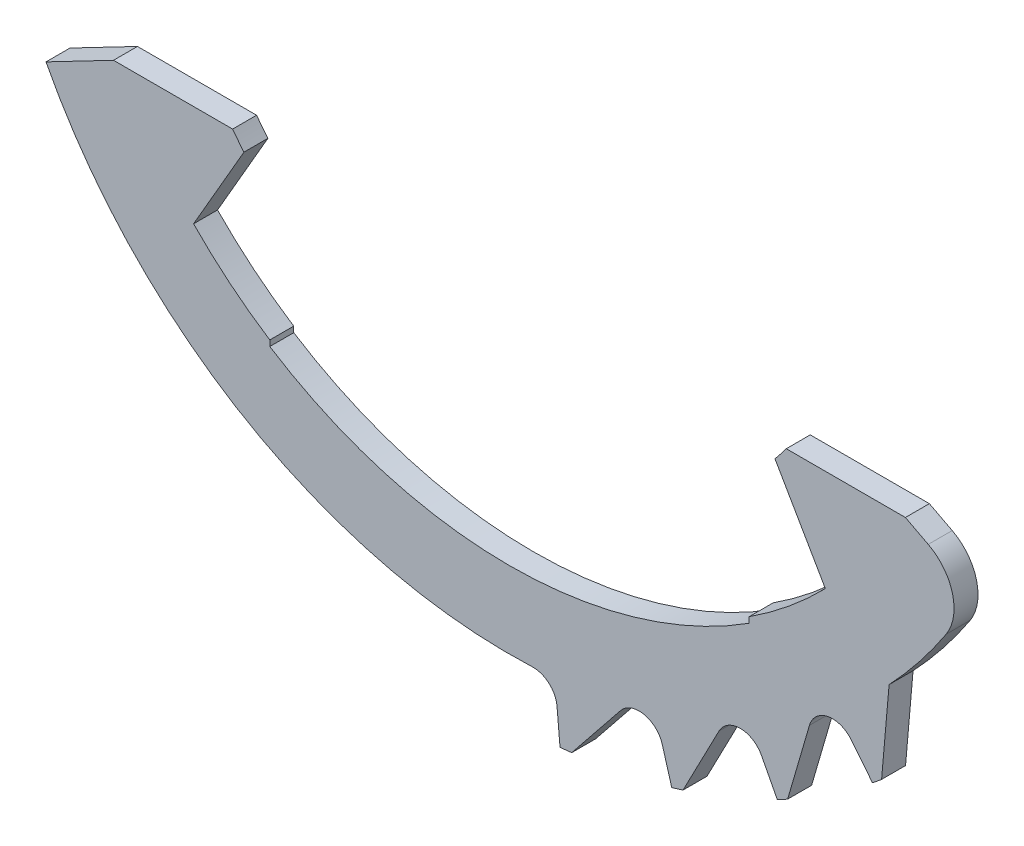
ISO-10303-21;
HEADER;
FILE_DESCRIPTION(('STEP AP214'),'2;1');
FILE_NAME('part.step','',(''),(''),'','','');
FILE_SCHEMA(('AUTOMOTIVE_DESIGN { 1 0 10303 214 1 1 1 1 }'));
ENDSEC;
DATA;
#1=APPLICATION_CONTEXT('core data for automotive mechanical design processes');
#2=APPLICATION_PROTOCOL_DEFINITION('international standard','automotive_design',2000,#1);
#3=PRODUCT_CONTEXT('',#1,'mechanical');
#4=PRODUCT('Part','Part','',(#3));
#5=PRODUCT_RELATED_PRODUCT_CATEGORY('part','',(#4));
#6=PRODUCT_DEFINITION_FORMATION('','',#4);
#7=PRODUCT_DEFINITION_CONTEXT('part definition',#1,'design');
#8=PRODUCT_DEFINITION('design','',#6,#7);
#9=PRODUCT_DEFINITION_SHAPE('','',#8);
#10=(LENGTH_UNIT() NAMED_UNIT(*) SI_UNIT(.MILLI.,.METRE.));
#11=(NAMED_UNIT(*) PLANE_ANGLE_UNIT() SI_UNIT($,.RADIAN.));
#12=(NAMED_UNIT(*) SI_UNIT($,.STERADIAN.) SOLID_ANGLE_UNIT());
#13=UNCERTAINTY_MEASURE_WITH_UNIT(LENGTH_MEASURE(1.E-05),#10,'distance_accuracy_value','');
#14=(GEOMETRIC_REPRESENTATION_CONTEXT(3) GLOBAL_UNCERTAINTY_ASSIGNED_CONTEXT((#13)) GLOBAL_UNIT_ASSIGNED_CONTEXT((#10,
#11,#12)) REPRESENTATION_CONTEXT('',''));
#15=CARTESIAN_POINT('',(0.,0.,0.));
#16=DIRECTION('',(0.,0.,1.));
#17=DIRECTION('',(1.,0.,0.));
#18=AXIS2_PLACEMENT_3D('',#15,#16,#17);
#19=CARTESIAN_POINT('',(0.49452200316987,-11.3892689839331,-0.00100000000000002));
#20=DIRECTION('',(0.,0.,1.));
#21=DIRECTION('',(1.,0.,0.));
#22=AXIS2_PLACEMENT_3D('',#19,#20,#21);
#23=CYLINDRICAL_SURFACE('',#22,0.5);
#24=DIRECTION('',(0.,0.,1.));
#25=VECTOR('',#24,1.);
#26=CARTESIAN_POINT('',(0.472832441627336,-10.8897396425325,-0.00100000000000002));
#27=LINE('',#26,#25);
#28=CARTESIAN_POINT('',(0.472832441627336,-10.8897396425325,0.));
#29=VERTEX_POINT('',#28);
#30=CARTESIAN_POINT('',(0.472832441627336,-10.8897396425325,0.5));
#31=VERTEX_POINT('',#30);
#32=EDGE_CURVE('E272',#29,#31,#27,.T.);
#33=ORIENTED_EDGE('',*,*,#32,.F.);
#34=CARTESIAN_POINT('',(0.49452200316987,-11.3892689839331,0.));
#35=DIRECTION('',(0.,0.,-1.));
#36=DIRECTION('',(-1.,0.,0.));
#37=AXIS2_PLACEMENT_3D('',#34,#35,#36);
#38=CIRCLE('',#37,0.5);
#39=CARTESIAN_POINT('',(0.992619352215745,-11.3456911125593,0.));
#40=VERTEX_POINT('',#39);
#41=EDGE_CURVE('E477',#40,#29,#38,.F.);
#42=ORIENTED_EDGE('',*,*,#41,.F.);
#43=DIRECTION('',(0.,0.,1.));
#44=VECTOR('',#43,1.);
#45=CARTESIAN_POINT('',(0.992619352215745,-11.3456911125593,-0.00100000000000002));
#46=LINE('',#45,#44);
#47=CARTESIAN_POINT('',(0.992619352215745,-11.3456911125593,0.5));
#48=VERTEX_POINT('',#47);
#49=EDGE_CURVE('E486',#40,#48,#46,.T.);
#50=ORIENTED_EDGE('',*,*,#49,.T.);
#51=CARTESIAN_POINT('',(0.49452200316987,-11.3892689839331,0.5));
#52=DIRECTION('',(0.,0.,1.));
#53=DIRECTION('',(0.5555702330196,0.831469612302546,0.));
#54=AXIS2_PLACEMENT_3D('',#51,#52,#53);
#55=CIRCLE('',#54,0.5);
#56=EDGE_CURVE('E483',#48,#31,#55,.T.);
#57=ORIENTED_EDGE('',*,*,#56,.T.);
#58=EDGE_LOOP('',(#33,#42,#50,#57));
#59=FACE_BOUND('',#58,.T.);
#60=ADVANCED_FACE('F59',(#59),#23,.F.);
#61=CARTESIAN_POINT('',(0.,0.,0.5));
#62=DIRECTION('',(0.,0.,-1.));
#63=DIRECTION('',(-1.,0.,0.));
#64=AXIS2_PLACEMENT_3D('',#61,#62,#63);
#65=CYLINDRICAL_SURFACE('',#64,12.1);
#66=CARTESIAN_POINT('',(0.,0.,0.));
#67=DIRECTION('',(0.,0.,1.));
#68=DIRECTION('',(1.,0.,0.));
#69=AXIS2_PLACEMENT_3D('',#66,#67,#68);
#70=CIRCLE('',#69,12.1);
#71=CARTESIAN_POINT('',(7.57367401342711,-9.43660224542387,0.));
#72=VERTEX_POINT('',#71);
#73=CARTESIAN_POINT('',(7.76317902804415,-9.28132810423893,0.));
#74=VERTEX_POINT('',#73);
#75=EDGE_CURVE('E328',#72,#74,#70,.T.);
#76=ORIENTED_EDGE('',*,*,#75,.T.);
#77=DIRECTION('',(0.,0.,1.));
#78=VECTOR('',#77,1.);
#79=CARTESIAN_POINT('',(7.76317902804415,-9.28132810423893,-0.00100000000000002));
#80=LINE('',#79,#78);
#81=CARTESIAN_POINT('',(7.76317902804415,-9.28132810423893,0.5));
#82=VERTEX_POINT('',#81);
#83=EDGE_CURVE('E396',#74,#82,#80,.T.);
#84=ORIENTED_EDGE('',*,*,#83,.T.);
#85=CARTESIAN_POINT('',(0.,0.,0.5));
#86=DIRECTION('',(0.,0.,1.));
#87=DIRECTION('',(1.,0.,0.));
#88=AXIS2_PLACEMENT_3D('',#85,#86,#87);
#89=CIRCLE('',#88,12.1);
#90=CARTESIAN_POINT('',(7.57367401342711,-9.43660224542387,0.5));
#91=VERTEX_POINT('',#90);
#92=EDGE_CURVE('E290',#91,#82,#89,.T.);
#93=ORIENTED_EDGE('',*,*,#92,.F.);
#94=DIRECTION('',(0.,0.,1.));
#95=VECTOR('',#94,1.);
#96=CARTESIAN_POINT('',(7.57367401342711,-9.43660224542387,-0.00100000000000002));
#97=LINE('',#96,#95);
#98=EDGE_CURVE('E413',#72,#91,#97,.T.);
#99=ORIENTED_EDGE('',*,*,#98,.F.);
#100=EDGE_LOOP('',(#76,#84,#93,#99));
#101=FACE_BOUND('',#100,.T.);
#102=ADVANCED_FACE('F527',(#101),#65,.T.);
#103=CARTESIAN_POINT('',(5.5871582201439,-10.7328310814565,0.));
#104=VERTEX_POINT('',#103);
#105=CARTESIAN_POINT('',(5.80331443124744,-10.6175110836804,0.));
#106=VERTEX_POINT('',#105);
#107=EDGE_CURVE('E331',#104,#106,#70,.T.);
#108=ORIENTED_EDGE('',*,*,#107,.T.);
#109=DIRECTION('',(0.,0.,1.));
#110=VECTOR('',#109,1.);
#111=CARTESIAN_POINT('',(5.80331443124744,-10.6175110836804,-0.00100000000000002));
#112=LINE('',#111,#110);
#113=CARTESIAN_POINT('',(5.80331443124744,-10.6175110836804,0.5));
#114=VERTEX_POINT('',#113);
#115=EDGE_CURVE('E414',#106,#114,#112,.T.);
#116=ORIENTED_EDGE('',*,*,#115,.T.);
#117=CARTESIAN_POINT('',(5.5871582201439,-10.7328310814565,0.5));
#118=VERTEX_POINT('',#117);
#119=EDGE_CURVE('E293',#118,#114,#89,.T.);
#120=ORIENTED_EDGE('',*,*,#119,.F.);
#121=DIRECTION('',(0.,0.,1.));
#122=VECTOR('',#121,1.);
#123=CARTESIAN_POINT('',(5.5871582201439,-10.7328310814565,-0.00100000000000002));
#124=LINE('',#123,#122);
#125=EDGE_CURVE('E439',#104,#118,#124,.T.);
#126=ORIENTED_EDGE('',*,*,#125,.F.);
#127=EDGE_LOOP('',(#108,#116,#120,#126));
#128=FACE_BOUND('',#127,.T.);
#129=ADVANCED_FACE('F544',(#128),#65,.T.);
#130=CARTESIAN_POINT('',(3.38593106977499,-11.6166032380697,0.));
#131=VERTEX_POINT('',#130);
#132=CARTESIAN_POINT('',(3.62043171539412,-11.5456690665448,0.));
#133=VERTEX_POINT('',#132);
#134=EDGE_CURVE('E546',#131,#133,#70,.T.);
#135=ORIENTED_EDGE('',*,*,#134,.T.);
#136=DIRECTION('',(0.,0.,1.));
#137=VECTOR('',#136,1.);
#138=CARTESIAN_POINT('',(3.62043171539412,-11.5456690665448,-0.00100000000000002));
#139=LINE('',#138,#137);
#140=CARTESIAN_POINT('',(3.62043171539412,-11.5456690665448,0.5));
#141=VERTEX_POINT('',#140);
#142=EDGE_CURVE('E440',#133,#141,#139,.T.);
#143=ORIENTED_EDGE('',*,*,#142,.T.);
#144=CARTESIAN_POINT('',(3.38593106977499,-11.6166032380697,0.5));
#145=VERTEX_POINT('',#144);
#146=EDGE_CURVE('E568',#145,#141,#89,.T.);
#147=ORIENTED_EDGE('',*,*,#146,.F.);
#148=DIRECTION('',(0.,0.,1.));
#149=VECTOR('',#148,1.);
#150=CARTESIAN_POINT('',(3.38593106977499,-11.6166032380697,-0.00100000000000002));
#151=LINE('',#150,#149);
#152=EDGE_CURVE('E465',#131,#145,#151,.T.);
#153=ORIENTED_EDGE('',*,*,#152,.F.);
#154=EDGE_LOOP('',(#135,#143,#147,#153));
#155=FACE_BOUND('',#154,.T.);
#156=ADVANCED_FACE('F582',(#155),#65,.T.);
#157=CARTESIAN_POINT('',(1.05458448724664,-12.0539558469101,0.));
#158=VERTEX_POINT('',#157);
#159=CARTESIAN_POINT('',(1.2984178390797,-12.0301334620676,0.));
#160=VERTEX_POINT('',#159);
#161=EDGE_CURVE('E332',#158,#160,#70,.T.);
#162=ORIENTED_EDGE('',*,*,#161,.T.);
#163=DIRECTION('',(0.,0.,1.));
#164=VECTOR('',#163,1.);
#165=CARTESIAN_POINT('',(1.2984178390797,-12.0301334620676,-0.00100000000000002));
#166=LINE('',#165,#164);
#167=CARTESIAN_POINT('',(1.2984178390797,-12.0301334620676,0.5));
#168=VERTEX_POINT('',#167);
#169=EDGE_CURVE('E466',#160,#168,#166,.T.);
#170=ORIENTED_EDGE('',*,*,#169,.T.);
#171=CARTESIAN_POINT('',(1.05458448724664,-12.0539558469101,0.5));
#172=VERTEX_POINT('',#171);
#173=EDGE_CURVE('E295',#172,#168,#89,.T.);
#174=ORIENTED_EDGE('',*,*,#173,.F.);
#175=DIRECTION('',(0.,0.,1.));
#176=VECTOR('',#175,1.);
#177=CARTESIAN_POINT('',(1.05458448724664,-12.0539558469101,-0.00100000000000002));
#178=LINE('',#177,#176);
#179=EDGE_CURVE('E485',#158,#172,#178,.T.);
#180=ORIENTED_EDGE('',*,*,#179,.F.);
#181=EDGE_LOOP('',(#162,#170,#174,#180));
#182=FACE_BOUND('',#181,.T.);
#183=ADVANCED_FACE('F555',(#182),#65,.T.);
#184=CARTESIAN_POINT('',(0.,0.,0.5));
#185=DIRECTION('',(0.,0.,-1.));
#186=DIRECTION('',(-1.,0.,0.));
#187=AXIS2_PLACEMENT_3D('',#184,#185,#186);
#188=CYLINDRICAL_SURFACE('',#187,7.2);
#189=CARTESIAN_POINT('',(0.,0.,0.));
#190=DIRECTION('',(0.,0.,-1.));
#191=DIRECTION('',(-1.,0.,0.));
#192=AXIS2_PLACEMENT_3D('',#189,#190,#191);
#193=CIRCLE('',#192,7.2);
#194=CARTESIAN_POINT('',(5.77494588719236,-4.3,0.));
#195=VERTEX_POINT('',#194);
#196=CARTESIAN_POINT('',(5.53923133011576,-4.5996647999027,0.));
#197=VERTEX_POINT('',#196);
#198=EDGE_CURVE('E305',#195,#197,#193,.T.);
#199=ORIENTED_EDGE('',*,*,#198,.T.);
#200=DIRECTION('',(0.,0.,-1.));
#201=VECTOR('',#200,1.);
#202=CARTESIAN_POINT('',(5.53923133011576,-4.5996647999027,0.5));
#203=LINE('',#202,#201);
#204=CARTESIAN_POINT('',(5.53923133011576,-4.5996647999027,0.5));
#205=VERTEX_POINT('',#204);
#206=EDGE_CURVE('E369',#205,#197,#203,.T.);
#207=ORIENTED_EDGE('',*,*,#206,.F.);
#208=CARTESIAN_POINT('',(0.,0.,0.5));
#209=DIRECTION('',(0.,0.,-1.));
#210=DIRECTION('',(-1.,0.,0.));
#211=AXIS2_PLACEMENT_3D('',#208,#209,#210);
#212=CIRCLE('',#211,7.2);
#213=CARTESIAN_POINT('',(5.77494588719236,-4.3,0.5));
#214=VERTEX_POINT('',#213);
#215=EDGE_CURVE('E337',#214,#205,#212,.T.);
#216=ORIENTED_EDGE('',*,*,#215,.F.);
#217=DIRECTION('',(0.,0.,-1.));
#218=VECTOR('',#217,1.);
#219=CARTESIAN_POINT('',(5.77494588719236,-4.3,0.5));
#220=LINE('',#219,#218);
#221=EDGE_CURVE('E304',#214,#195,#220,.T.);
#222=ORIENTED_EDGE('',*,*,#221,.T.);
#223=EDGE_LOOP('',(#199,#207,#216,#222));
#224=FACE_BOUND('',#223,.T.);
#225=ADVANCED_FACE('F648',(#224),#188,.F.);
#226=CARTESIAN_POINT('',(5.53923133011576,-4.5996647999027,0.5));
#227=DIRECTION('',(0.866025403784438,0.500000000000001,0.));
#228=DIRECTION('',(-0.500000000000001,0.866025403784438,0.));
#229=AXIS2_PLACEMENT_3D('',#226,#227,#228);
#230=PLANE('',#229);
#231=DIRECTION('',(0.500000000000001,-0.866025403784438,0.));
#232=VECTOR('',#231,1.);
#233=CARTESIAN_POINT('',(5.53923133011576,-4.5996647999027,0.));
#234=LINE('',#233,#232);
#235=CARTESIAN_POINT('',(6.59,-6.41964952314377,0.));
#236=VERTEX_POINT('',#235);
#237=EDGE_CURVE('E308',#197,#236,#234,.T.);
#238=ORIENTED_EDGE('',*,*,#237,.T.);
#239=DIRECTION('',(0.,0.,-1.));
#240=VECTOR('',#239,1.);
#241=CARTESIAN_POINT('',(6.59,-6.41964952314377,0.5));
#242=LINE('',#241,#240);
#243=CARTESIAN_POINT('',(6.59,-6.41964952314377,0.5));
#244=VERTEX_POINT('',#243);
#245=EDGE_CURVE('E366',#244,#236,#242,.T.);
#246=ORIENTED_EDGE('',*,*,#245,.F.);
#247=DIRECTION('',(0.500000000000001,-0.866025403784438,0.));
#248=VECTOR('',#247,1.);
#249=CARTESIAN_POINT('',(5.53923133011576,-4.5996647999027,0.5));
#250=LINE('',#249,#248);
#251=EDGE_CURVE('E493',#205,#244,#250,.T.);
#252=ORIENTED_EDGE('',*,*,#251,.F.);
#253=ORIENTED_EDGE('',*,*,#206,.T.);
#254=EDGE_LOOP('',(#238,#246,#252,#253));
#255=FACE_BOUND('',#254,.T.);
#256=ADVANCED_FACE('F645',(#255),#230,.F.);
#257=CARTESIAN_POINT('',(0.,0.,0.5));
#258=DIRECTION('',(0.,0.,-1.));
#259=DIRECTION('',(-1.,0.,0.));
#260=AXIS2_PLACEMENT_3D('',#257,#258,#259);
#261=CYLINDRICAL_SURFACE('',#260,9.2);
#262=CARTESIAN_POINT('',(0.,0.,0.));
#263=DIRECTION('',(0.,0.,-1.));
#264=DIRECTION('',(1.,0.,0.));
#265=AXIS2_PLACEMENT_3D('',#262,#263,#264);
#266=CIRCLE('',#265,9.2);
#267=CARTESIAN_POINT('',(5.,-7.72269383052313,0.));
#268=VERTEX_POINT('',#267);
#269=EDGE_CURVE('E311',#236,#268,#266,.T.);
#270=ORIENTED_EDGE('',*,*,#269,.T.);
#271=DIRECTION('',(0.,0.,-1.));
#272=VECTOR('',#271,1.);
#273=CARTESIAN_POINT('',(5.,-7.72269383052313,0.5));
#274=LINE('',#273,#272);
#275=CARTESIAN_POINT('',(5.,-7.72269383052313,0.5));
#276=VERTEX_POINT('',#275);
#277=EDGE_CURVE('E363',#276,#268,#274,.T.);
#278=ORIENTED_EDGE('',*,*,#277,.F.);
#279=CARTESIAN_POINT('',(0.,0.,0.5));
#280=DIRECTION('',(0.,0.,-1.));
#281=DIRECTION('',(1.,0.,0.));
#282=AXIS2_PLACEMENT_3D('',#279,#280,#281);
#283=CIRCLE('',#282,9.2);
#284=EDGE_CURVE('E495',#244,#276,#283,.T.);
#285=ORIENTED_EDGE('',*,*,#284,.F.);
#286=ORIENTED_EDGE('',*,*,#245,.T.);
#287=EDGE_LOOP('',(#270,#278,#285,#286));
#288=FACE_BOUND('',#287,.T.);
#289=ADVANCED_FACE('F641',(#288),#261,.F.);
#290=CARTESIAN_POINT('',(5.,-7.72269383052313,0.5));
#291=DIRECTION('',(1.,0.,0.));
#292=DIRECTION('',(0.,0.,-1.));
#293=AXIS2_PLACEMENT_3D('',#290,#291,#292);
#294=PLANE('',#293);
#295=DIRECTION('',(0.,-1.,0.));
#296=VECTOR('',#295,1.);
#297=CARTESIAN_POINT('',(5.,-7.72269383052313,0.));
#298=LINE('',#297,#296);
#299=CARTESIAN_POINT('',(4.99999999999999,-7.84155596804614,0.));
#300=VERTEX_POINT('',#299);
#301=EDGE_CURVE('E313',#268,#300,#298,.T.);
#302=ORIENTED_EDGE('',*,*,#301,.T.);
#303=DIRECTION('',(0.,0.,-1.));
#304=VECTOR('',#303,1.);
#305=CARTESIAN_POINT('',(4.99999999999999,-7.84155596804614,0.5));
#306=LINE('',#305,#304);
#307=CARTESIAN_POINT('',(4.99999999999999,-7.84155596804614,0.5));
#308=VERTEX_POINT('',#307);
#309=EDGE_CURVE('E360',#308,#300,#306,.T.);
#310=ORIENTED_EDGE('',*,*,#309,.F.);
#311=DIRECTION('',(0.,-1.,0.));
#312=VECTOR('',#311,1.);
#313=CARTESIAN_POINT('',(5.,-7.72269383052313,0.5));
#314=LINE('',#313,#312);
#315=EDGE_CURVE('E497',#276,#308,#314,.T.);
#316=ORIENTED_EDGE('',*,*,#315,.F.);
#317=ORIENTED_EDGE('',*,*,#277,.T.);
#318=EDGE_LOOP('',(#302,#310,#316,#317));
#319=FACE_BOUND('',#318,.T.);
#320=ADVANCED_FACE('F637',(#319),#294,.F.);
#321=CARTESIAN_POINT('',(0.,0.,0.5));
#322=DIRECTION('',(0.,0.,-1.));
#323=DIRECTION('',(-1.,0.,0.));
#324=AXIS2_PLACEMENT_3D('',#321,#322,#323);
#325=CYLINDRICAL_SURFACE('',#324,9.3);
#326=CARTESIAN_POINT('',(0.,0.,0.));
#327=DIRECTION('',(0.,0.,-1.));
#328=DIRECTION('',(1.,0.,0.));
#329=AXIS2_PLACEMENT_3D('',#326,#327,#328);
#330=CIRCLE('',#329,9.3);
#331=CARTESIAN_POINT('',(-5.,-7.84155596804614,0.));
#332=VERTEX_POINT('',#331);
#333=EDGE_CURVE('E315',#300,#332,#330,.T.);
#334=ORIENTED_EDGE('',*,*,#333,.T.);
#335=DIRECTION('',(0.,0.,-1.));
#336=VECTOR('',#335,1.);
#337=CARTESIAN_POINT('',(-5.,-7.84155596804614,0.5));
#338=LINE('',#337,#336);
#339=CARTESIAN_POINT('',(-5.,-7.84155596804614,0.5));
#340=VERTEX_POINT('',#339);
#341=EDGE_CURVE('E357',#340,#332,#338,.T.);
#342=ORIENTED_EDGE('',*,*,#341,.F.);
#343=CARTESIAN_POINT('',(0.,0.,0.5));
#344=DIRECTION('',(0.,0.,-1.));
#345=DIRECTION('',(1.,0.,0.));
#346=AXIS2_PLACEMENT_3D('',#343,#344,#345);
#347=CIRCLE('',#346,9.3);
#348=EDGE_CURVE('E499',#308,#340,#347,.T.);
#349=ORIENTED_EDGE('',*,*,#348,.F.);
#350=ORIENTED_EDGE('',*,*,#309,.T.);
#351=EDGE_LOOP('',(#334,#342,#349,#350));
#352=FACE_BOUND('',#351,.T.);
#353=ADVANCED_FACE('F633',(#352),#325,.F.);
#354=CARTESIAN_POINT('',(-5.,-7.72269383052313,0.5));
#355=DIRECTION('',(-1.,0.,0.));
#356=DIRECTION('',(0.,0.,1.));
#357=AXIS2_PLACEMENT_3D('',#354,#355,#356);
#358=PLANE('',#357);
#359=DIRECTION('',(0.,1.,0.));
#360=VECTOR('',#359,1.);
#361=CARTESIAN_POINT('',(-5.,-7.72269383052313,0.));
#362=LINE('',#361,#360);
#363=CARTESIAN_POINT('',(-5.00000000000001,-7.72269383052313,0.));
#364=VERTEX_POINT('',#363);
#365=EDGE_CURVE('E317',#332,#364,#362,.T.);
#366=ORIENTED_EDGE('',*,*,#365,.T.);
#367=DIRECTION('',(0.,0.,-1.));
#368=VECTOR('',#367,1.);
#369=CARTESIAN_POINT('',(-5.00000000000001,-7.72269383052313,0.5));
#370=LINE('',#369,#368);
#371=CARTESIAN_POINT('',(-5.00000000000001,-7.72269383052313,0.5));
#372=VERTEX_POINT('',#371);
#373=EDGE_CURVE('E354',#372,#364,#370,.T.);
#374=ORIENTED_EDGE('',*,*,#373,.F.);
#375=DIRECTION('',(0.,1.,0.));
#376=VECTOR('',#375,1.);
#377=CARTESIAN_POINT('',(-5.,-7.72269383052313,0.5));
#378=LINE('',#377,#376);
#379=EDGE_CURVE('E501',#340,#372,#378,.T.);
#380=ORIENTED_EDGE('',*,*,#379,.F.);
#381=ORIENTED_EDGE('',*,*,#341,.T.);
#382=EDGE_LOOP('',(#366,#374,#380,#381));
#383=FACE_BOUND('',#382,.T.);
#384=ADVANCED_FACE('F629',(#383),#358,.F.);
#385=CARTESIAN_POINT('',(0.,0.,0.5));
#386=DIRECTION('',(0.,0.,-1.));
#387=DIRECTION('',(-1.,0.,0.));
#388=AXIS2_PLACEMENT_3D('',#385,#386,#387);
#389=CYLINDRICAL_SURFACE('',#388,9.2);
#390=CARTESIAN_POINT('',(0.,0.,0.));
#391=DIRECTION('',(0.,0.,-1.));
#392=DIRECTION('',(1.,0.,0.));
#393=AXIS2_PLACEMENT_3D('',#390,#391,#392);
#394=CIRCLE('',#393,9.2);
#395=CARTESIAN_POINT('',(-6.59,-6.41964952314377,0.));
#396=VERTEX_POINT('',#395);
#397=EDGE_CURVE('E319',#364,#396,#394,.T.);
#398=ORIENTED_EDGE('',*,*,#397,.T.);
#399=DIRECTION('',(0.,0.,-1.));
#400=VECTOR('',#399,1.);
#401=CARTESIAN_POINT('',(-6.59,-6.41964952314377,0.5));
#402=LINE('',#401,#400);
#403=CARTESIAN_POINT('',(-6.59,-6.41964952314377,0.5));
#404=VERTEX_POINT('',#403);
#405=EDGE_CURVE('E351',#404,#396,#402,.T.);
#406=ORIENTED_EDGE('',*,*,#405,.F.);
#407=CARTESIAN_POINT('',(0.,0.,0.5));
#408=DIRECTION('',(0.,0.,-1.));
#409=DIRECTION('',(1.,0.,0.));
#410=AXIS2_PLACEMENT_3D('',#407,#408,#409);
#411=CIRCLE('',#410,9.2);
#412=EDGE_CURVE('E503',#372,#404,#411,.T.);
#413=ORIENTED_EDGE('',*,*,#412,.F.);
#414=ORIENTED_EDGE('',*,*,#373,.T.);
#415=EDGE_LOOP('',(#398,#406,#413,#414));
#416=FACE_BOUND('',#415,.T.);
#417=ADVANCED_FACE('F625',(#416),#389,.F.);
#418=CARTESIAN_POINT('',(-5.53923133011576,-4.5996647999027,0.5));
#419=DIRECTION('',(-0.866025403784438,0.500000000000001,0.));
#420=DIRECTION('',(-0.500000000000001,-0.866025403784438,0.));
#421=AXIS2_PLACEMENT_3D('',#418,#419,#420);
#422=PLANE('',#421);
#423=DIRECTION('',(0.500000000000001,0.866025403784438,0.));
#424=VECTOR('',#423,1.);
#425=CARTESIAN_POINT('',(-5.53923133011576,-4.5996647999027,0.));
#426=LINE('',#425,#424);
#427=CARTESIAN_POINT('',(-5.53923133011576,-4.5996647999027,0.));
#428=VERTEX_POINT('',#427);
#429=EDGE_CURVE('E321',#396,#428,#426,.T.);
#430=ORIENTED_EDGE('',*,*,#429,.T.);
#431=DIRECTION('',(0.,0.,-1.));
#432=VECTOR('',#431,1.);
#433=CARTESIAN_POINT('',(-5.53923133011576,-4.5996647999027,0.5));
#434=LINE('',#433,#432);
#435=CARTESIAN_POINT('',(-5.53923133011576,-4.5996647999027,0.5));
#436=VERTEX_POINT('',#435);
#437=EDGE_CURVE('E348',#436,#428,#434,.T.);
#438=ORIENTED_EDGE('',*,*,#437,.F.);
#439=DIRECTION('',(0.500000000000001,0.866025403784438,0.));
#440=VECTOR('',#439,1.);
#441=CARTESIAN_POINT('',(-5.53923133011576,-4.5996647999027,0.5));
#442=LINE('',#441,#440);
#443=EDGE_CURVE('E505',#404,#436,#442,.T.);
#444=ORIENTED_EDGE('',*,*,#443,.F.);
#445=ORIENTED_EDGE('',*,*,#405,.T.);
#446=EDGE_LOOP('',(#430,#438,#444,#445));
#447=FACE_BOUND('',#446,.T.);
#448=ADVANCED_FACE('F622',(#447),#422,.F.);
#449=CARTESIAN_POINT('',(0.,0.,0.5));
#450=DIRECTION('',(0.,0.,-1.));
#451=DIRECTION('',(-1.,0.,0.));
#452=AXIS2_PLACEMENT_3D('',#449,#450,#451);
#453=CYLINDRICAL_SURFACE('',#452,7.2);
#454=CARTESIAN_POINT('',(0.,0.,0.));
#455=DIRECTION('',(0.,0.,-1.));
#456=DIRECTION('',(1.,0.,0.));
#457=AXIS2_PLACEMENT_3D('',#454,#455,#456);
#458=CIRCLE('',#457,7.2);
#459=CARTESIAN_POINT('',(-5.77494588719236,-4.3,0.));
#460=VERTEX_POINT('',#459);
#461=EDGE_CURVE('E323',#428,#460,#458,.T.);
#462=ORIENTED_EDGE('',*,*,#461,.T.);
#463=DIRECTION('',(0.,0.,-1.));
#464=VECTOR('',#463,1.);
#465=CARTESIAN_POINT('',(-5.77494588719236,-4.3,0.5));
#466=LINE('',#465,#464);
#467=CARTESIAN_POINT('',(-5.77494588719236,-4.3,0.5));
#468=VERTEX_POINT('',#467);
#469=EDGE_CURVE('E345',#468,#460,#466,.T.);
#470=ORIENTED_EDGE('',*,*,#469,.F.);
#471=CARTESIAN_POINT('',(0.,0.,0.5));
#472=DIRECTION('',(0.,0.,-1.));
#473=DIRECTION('',(1.,0.,0.));
#474=AXIS2_PLACEMENT_3D('',#471,#472,#473);
#475=CIRCLE('',#474,7.2);
#476=EDGE_CURVE('E296',#436,#468,#475,.T.);
#477=ORIENTED_EDGE('',*,*,#476,.F.);
#478=ORIENTED_EDGE('',*,*,#437,.T.);
#479=EDGE_LOOP('',(#462,#470,#477,#478));
#480=FACE_BOUND('',#479,.T.);
#481=ADVANCED_FACE('F511',(#480),#453,.F.);
#482=CARTESIAN_POINT('',(-8.26022314597606,-4.3,0.5));
#483=DIRECTION('',(0.,-1.,0.));
#484=DIRECTION('',(1.,0.,0.));
#485=AXIS2_PLACEMENT_3D('',#482,#483,#484);
#486=PLANE('',#485);
#487=DIRECTION('',(-1.,0.,0.));
#488=VECTOR('',#487,1.);
#489=CARTESIAN_POINT('',(-8.26022314597606,-4.3,0.));
#490=LINE('',#489,#488);
#491=CARTESIAN_POINT('',(-8.26022314597606,-4.3,0.));
#492=VERTEX_POINT('',#491);
#493=EDGE_CURVE('E325',#460,#492,#490,.T.);
#494=ORIENTED_EDGE('',*,*,#493,.T.);
#495=DIRECTION('',(0.,0.,-1.));
#496=VECTOR('',#495,1.);
#497=CARTESIAN_POINT('',(-8.26022314597606,-4.3,0.5));
#498=LINE('',#497,#496);
#499=CARTESIAN_POINT('',(-8.26022314597606,-4.3,0.5));
#500=VERTEX_POINT('',#499);
#501=EDGE_CURVE('E343',#500,#492,#498,.T.);
#502=ORIENTED_EDGE('',*,*,#501,.F.);
#503=DIRECTION('',(-1.,0.,0.));
#504=VECTOR('',#503,1.);
#505=CARTESIAN_POINT('',(-8.26022314597606,-4.3,0.5));
#506=LINE('',#505,#504);
#507=EDGE_CURVE('E288',#468,#500,#506,.T.);
#508=ORIENTED_EDGE('',*,*,#507,.F.);
#509=ORIENTED_EDGE('',*,*,#469,.T.);
#510=EDGE_LOOP('',(#494,#502,#508,#509));
#511=FACE_BOUND('',#510,.T.);
#512=ADVANCED_FACE('F515',(#511),#486,.F.);
#513=CARTESIAN_POINT('',(-8.26022314597606,-4.3,0.5));
#514=DIRECTION('',(0.461748613235031,-0.887010833178223,0.));
#515=DIRECTION('',(0.887010833178223,0.461748613235031,0.));
#516=AXIS2_PLACEMENT_3D('',#513,#514,#515);
#517=PLANE('',#516);
#518=DIRECTION('',(-0.887010833178223,-0.461748613235031,0.));
#519=VECTOR('',#518,1.);
#520=CARTESIAN_POINT('',(-8.26022314597606,-4.3,0.));
#521=LINE('',#520,#519);
#522=CARTESIAN_POINT('',(-9.66841808164263,-5.03305988426184,0.));
#523=VERTEX_POINT('',#522);
#524=EDGE_CURVE('E284',#492,#523,#521,.T.);
#525=ORIENTED_EDGE('',*,*,#524,.T.);
#526=DIRECTION('',(0.,0.,1.));
#527=VECTOR('',#526,1.);
#528=CARTESIAN_POINT('',(-9.66841808164263,-5.03305988426184,-0.00100000000000002));
#529=LINE('',#528,#527);
#530=CARTESIAN_POINT('',(-9.66841808164263,-5.03305988426184,0.5));
#531=VERTEX_POINT('',#530);
#532=EDGE_CURVE('E269',#523,#531,#529,.T.);
#533=ORIENTED_EDGE('',*,*,#532,.T.);
#534=DIRECTION('',(-0.887010833178223,-0.461748613235031,0.));
#535=VECTOR('',#534,1.);
#536=CARTESIAN_POINT('',(-8.26022314597606,-4.3,0.5));
#537=LINE('',#536,#535);
#538=EDGE_CURVE('E282',#500,#531,#537,.T.);
#539=ORIENTED_EDGE('',*,*,#538,.F.);
#540=ORIENTED_EDGE('',*,*,#501,.T.);
#541=EDGE_LOOP('',(#525,#533,#539,#540));
#542=FACE_BOUND('',#541,.T.);
#543=ADVANCED_FACE('F280',(#542),#517,.F.);
#544=CARTESIAN_POINT('',(8.26022314597606,-4.3,0.5));
#545=DIRECTION('',(-0.461748613235032,-0.887010833178223,0.));
#546=DIRECTION('',(0.887010833178223,-0.461748613235032,0.));
#547=AXIS2_PLACEMENT_3D('',#544,#545,#546);
#548=PLANE('',#547);
#549=DIRECTION('',(-0.887010833178223,0.461748613235032,0.));
#550=VECTOR('',#549,1.);
#551=CARTESIAN_POINT('',(8.26022314597606,-4.3,0.5));
#552=LINE('',#551,#550);
#553=CARTESIAN_POINT('',(8.73649386454358,-4.54793084322885,0.5));
#554=VERTEX_POINT('',#553);
#555=CARTESIAN_POINT('',(8.26022314597606,-4.3,0.5));
#556=VERTEX_POINT('',#555);
#557=EDGE_CURVE('E300',#554,#556,#552,.T.);
#558=ORIENTED_EDGE('',*,*,#557,.F.);
#559=DIRECTION('',(0.,0.,1.));
#560=VECTOR('',#559,1.);
#561=CARTESIAN_POINT('',(8.73649386454358,-4.54793084322885,0.5));
#562=LINE('',#561,#560);
#563=CARTESIAN_POINT('',(8.73649386454358,-4.54793084322885,0.));
#564=VERTEX_POINT('',#563);
#565=EDGE_CURVE('E67',#554,#564,#562,.F.);
#566=ORIENTED_EDGE('',*,*,#565,.T.);
#567=DIRECTION('',(-0.887010833178223,0.461748613235032,0.));
#568=VECTOR('',#567,1.);
#569=CARTESIAN_POINT('',(8.26022314597606,-4.3,0.));
#570=LINE('',#569,#568);
#571=CARTESIAN_POINT('',(8.26022314597606,-4.3,0.));
#572=VERTEX_POINT('',#571);
#573=EDGE_CURVE('E333',#564,#572,#570,.T.);
#574=ORIENTED_EDGE('',*,*,#573,.T.);
#575=DIRECTION('',(0.,0.,-1.));
#576=VECTOR('',#575,1.);
#577=CARTESIAN_POINT('',(8.26022314597606,-4.3,0.5));
#578=LINE('',#577,#576);
#579=EDGE_CURVE('E340',#556,#572,#578,.T.);
#580=ORIENTED_EDGE('',*,*,#579,.F.);
#581=EDGE_LOOP('',(#558,#566,#574,#580));
#582=FACE_BOUND('',#581,.T.);
#583=ADVANCED_FACE('F612',(#582),#548,.F.);
#584=CARTESIAN_POINT('',(5.77494588719236,-4.3,0.5));
#585=DIRECTION('',(0.,-1.,0.));
#586=DIRECTION('',(1.,0.,0.));
#587=AXIS2_PLACEMENT_3D('',#584,#585,#586);
#588=PLANE('',#587);
#589=DIRECTION('',(-1.,0.,0.));
#590=VECTOR('',#589,1.);
#591=CARTESIAN_POINT('',(5.77494588719236,-4.3,0.));
#592=LINE('',#591,#590);
#593=EDGE_CURVE('E335',#572,#195,#592,.T.);
#594=ORIENTED_EDGE('',*,*,#593,.T.);
#595=ORIENTED_EDGE('',*,*,#221,.F.);
#596=DIRECTION('',(-1.,0.,0.));
#597=VECTOR('',#596,1.);
#598=CARTESIAN_POINT('',(5.77494588719236,-4.3,0.5));
#599=LINE('',#598,#597);
#600=EDGE_CURVE('E302',#556,#214,#599,.T.);
#601=ORIENTED_EDGE('',*,*,#600,.F.);
#602=ORIENTED_EDGE('',*,*,#579,.T.);
#603=EDGE_LOOP('',(#594,#595,#601,#602));
#604=FACE_BOUND('',#603,.T.);
#605=ADVANCED_FACE('F607',(#604),#588,.F.);
#606=CARTESIAN_POINT('',(0.,0.,0.5));
#607=DIRECTION('',(0.,0.,-1.));
#608=DIRECTION('',(-1.,0.,0.));
#609=AXIS2_PLACEMENT_3D('',#606,#607,#608);
#610=PLANE('',#609);
#611=ORIENTED_EDGE('',*,*,#538,.T.);
#612=CARTESIAN_POINT('',(0.,0.,0.5));
#613=DIRECTION('',(0.,0.,-1.));
#614=DIRECTION('',(1.,0.,0.));
#615=AXIS2_PLACEMENT_3D('',#612,#613,#614);
#616=CIRCLE('',#615,10.9);
#617=EDGE_CURVE('E266',#31,#531,#616,.T.);
#618=ORIENTED_EDGE('',*,*,#617,.F.);
#619=ORIENTED_EDGE('',*,*,#56,.F.);
#620=DIRECTION('',(-0.0871557427476559,0.996194698091746,0.));
#621=VECTOR('',#620,1.);
#622=CARTESIAN_POINT('',(0.992619352215745,-11.3456911125593,0.5));
#623=LINE('',#622,#621);
#624=EDGE_CURVE('E480',#172,#48,#623,.T.);
#625=ORIENTED_EDGE('',*,*,#624,.F.);
#626=ORIENTED_EDGE('',*,*,#173,.T.);
#627=DIRECTION('',(-0.625923472184057,-0.779884483092884,0.));
#628=VECTOR('',#627,1.);
#629=CARTESIAN_POINT('',(1.2984178390797,-12.0301334620676,0.5));
#630=LINE('',#629,#628);
#631=CARTESIAN_POINT('',(2.3170138136019,-10.7609891810602,0.5));
#632=VERTEX_POINT('',#631);
#633=EDGE_CURVE('E463',#632,#168,#630,.T.);
#634=ORIENTED_EDGE('',*,*,#633,.F.);
#635=CARTESIAN_POINT('',(2.70695605514835,-11.0739509171522,0.5));
#636=DIRECTION('',(0.,0.,1.));
#637=DIRECTION('',(0.382683432365087,0.923879532511288,0.));
#638=AXIS2_PLACEMENT_3D('',#635,#636,#637);
#639=CIRCLE('',#638,0.5);
#640=CARTESIAN_POINT('',(3.18698098234131,-10.9340364101367,0.5));
#641=VERTEX_POINT('',#640);
#642=EDGE_CURVE('E460',#641,#632,#639,.T.);
#643=ORIENTED_EDGE('',*,*,#642,.F.);
#644=DIRECTION('',(-0.27982901403099,0.960049854385929,0.));
#645=VECTOR('',#644,1.);
#646=CARTESIAN_POINT('',(3.18698098234131,-10.9340364101367,0.5));
#647=LINE('',#646,#645);
#648=EDGE_CURVE('E457',#145,#641,#647,.T.);
#649=ORIENTED_EDGE('',*,*,#648,.F.);
#650=ORIENTED_EDGE('',*,*,#146,.T.);
#651=DIRECTION('',(-0.461748613235031,-0.887010833178223,0.));
#652=VECTOR('',#651,1.);
#653=CARTESIAN_POINT('',(3.62043171539412,-11.5456690665448,0.5));
#654=LINE('',#653,#652);
#655=CARTESIAN_POINT('',(4.37185788741681,-10.1021928203508,0.5));
#656=VERTEX_POINT('',#655);
#657=EDGE_CURVE('E437',#656,#141,#654,.T.);
#658=ORIENTED_EDGE('',*,*,#657,.F.);
#659=CARTESIAN_POINT('',(4.81536330400592,-10.3330671269683,0.5));
#660=DIRECTION('',(0.,0.,1.));
#661=DIRECTION('',(0.195090322016125,0.980785280403231,0.));
#662=AXIS2_PLACEMENT_3D('',#659,#660,#661);
#663=CIRCLE('',#662,0.5);
#664=CARTESIAN_POINT('',(5.25886872059503,-10.1021928203508,0.5));
#665=VERTEX_POINT('',#664);
#666=EDGE_CURVE('E434',#665,#656,#663,.T.);
#667=ORIENTED_EDGE('',*,*,#666,.F.);
#668=DIRECTION('',(-0.461748613235033,0.887010833178222,0.));
#669=VECTOR('',#668,1.);
#670=CARTESIAN_POINT('',(5.25886872059503,-10.1021928203508,0.5));
#671=LINE('',#670,#669);
#672=EDGE_CURVE('E431',#118,#665,#671,.T.);
#673=ORIENTED_EDGE('',*,*,#672,.F.);
#674=ORIENTED_EDGE('',*,*,#119,.T.);
#675=DIRECTION('',(-0.279829014030988,-0.96004985438593,0.));
#676=VECTOR('',#675,1.);
#677=CARTESIAN_POINT('',(5.80331443124744,-10.6175110836804,0.5));
#678=LINE('',#677,#676);
#679=CARTESIAN_POINT('',(6.25869391438443,-9.05517485493036,0.5));
#680=VERTEX_POINT('',#679);
#681=EDGE_CURVE('E411',#680,#114,#678,.T.);
#682=ORIENTED_EDGE('',*,*,#681,.F.);
#683=CARTESIAN_POINT('',(6.73871884157739,-9.19508936194586,0.5));
#684=DIRECTION('',(0.,0.,1.));
#685=DIRECTION('',(0.,1.,0.));
#686=AXIS2_PLACEMENT_3D('',#683,#684,#685);
#687=CIRCLE('',#686,0.5);
#688=CARTESIAN_POINT('',(7.12866108312383,-8.88212762585383,0.5));
#689=VERTEX_POINT('',#688);
#690=EDGE_CURVE('E408',#689,#680,#687,.T.);
#691=ORIENTED_EDGE('',*,*,#690,.F.);
#692=DIRECTION('',(-0.625923472184058,0.779884483092882,0.));
#693=VECTOR('',#692,1.);
#694=CARTESIAN_POINT('',(7.12866108312383,-8.88212762585383,0.5));
#695=LINE('',#694,#693);
#696=EDGE_CURVE('E405',#91,#689,#695,.T.);
#697=ORIENTED_EDGE('',*,*,#696,.F.);
#698=ORIENTED_EDGE('',*,*,#92,.T.);
#699=DIRECTION('',(-0.0871557427476539,-0.996194698091746,0.));
#700=VECTOR('',#699,1.);
#701=CARTESIAN_POINT('',(7.76317902804415,-9.28132810423893,0.5));
#702=LINE('',#701,#700);
#703=CARTESIAN_POINT('',(7.91999592597633,-7.48890275891724,0.5));
#704=VERTEX_POINT('',#703);
#705=EDGE_CURVE('E385',#704,#82,#702,.T.);
#706=ORIENTED_EDGE('',*,*,#705,.F.);
#707=CARTESIAN_POINT('',(0.,0.,0.5));
#708=DIRECTION('',(0.,0.,-1.));
#709=DIRECTION('',(-1.,0.,0.));
#710=AXIS2_PLACEMENT_3D('',#707,#708,#709);
#711=CIRCLE('',#710,10.9);
#712=CARTESIAN_POINT('',(9.11057810497609,-5.98392568412496,0.5));
#713=VERTEX_POINT('',#712);
#714=EDGE_CURVE('E380',#713,#704,#711,.T.);
#715=ORIENTED_EDGE('',*,*,#714,.F.);
#716=CARTESIAN_POINT('',(8.27474525130855,-5.43494167640707,0.5));
#717=DIRECTION('',(0.,0.,-1.));
#718=DIRECTION('',(-1.,0.,0.));
#719=AXIS2_PLACEMENT_3D('',#716,#717,#718);
#720=CIRCLE('',#719,1.);
#721=EDGE_CURVE('E81',#713,#554,#720,.F.);
#722=ORIENTED_EDGE('',*,*,#721,.T.);
#723=ORIENTED_EDGE('',*,*,#557,.T.);
#724=ORIENTED_EDGE('',*,*,#600,.T.);
#725=ORIENTED_EDGE('',*,*,#215,.T.);
#726=ORIENTED_EDGE('',*,*,#251,.T.);
#727=ORIENTED_EDGE('',*,*,#284,.T.);
#728=ORIENTED_EDGE('',*,*,#315,.T.);
#729=ORIENTED_EDGE('',*,*,#348,.T.);
#730=ORIENTED_EDGE('',*,*,#379,.T.);
#731=ORIENTED_EDGE('',*,*,#412,.T.);
#732=ORIENTED_EDGE('',*,*,#443,.T.);
#733=ORIENTED_EDGE('',*,*,#476,.T.);
#734=ORIENTED_EDGE('',*,*,#507,.T.);
#735=EDGE_LOOP('',(#611,#618,#619,#625,#626,#634,#643,#649,#650,#658,#667,#673,#674,#682,#691,
#697,#698,#706,#715,#722,#723,#724,#725,#726,#727,#728,#729,#730,#731,#732,#733,#734));
#736=FACE_BOUND('',#735,.T.);
#737=ADVANCED_FACE('F286',(#736),#610,.F.);
#738=CARTESIAN_POINT('',(0.,0.,0.));
#739=DIRECTION('',(0.,0.,-1.));
#740=DIRECTION('',(-1.,0.,0.));
#741=AXIS2_PLACEMENT_3D('',#738,#739,#740);
#742=PLANE('',#741);
#743=CARTESIAN_POINT('',(0.,0.,0.));
#744=DIRECTION('',(0.,0.,-1.));
#745=DIRECTION('',(-1.,0.,0.));
#746=AXIS2_PLACEMENT_3D('',#743,#744,#745);
#747=CIRCLE('',#746,10.9);
#748=EDGE_CURVE('E276',#29,#523,#747,.T.);
#749=ORIENTED_EDGE('',*,*,#748,.T.);
#750=ORIENTED_EDGE('',*,*,#524,.F.);
#751=ORIENTED_EDGE('',*,*,#493,.F.);
#752=ORIENTED_EDGE('',*,*,#461,.F.);
#753=ORIENTED_EDGE('',*,*,#429,.F.);
#754=ORIENTED_EDGE('',*,*,#397,.F.);
#755=ORIENTED_EDGE('',*,*,#365,.F.);
#756=ORIENTED_EDGE('',*,*,#333,.F.);
#757=ORIENTED_EDGE('',*,*,#301,.F.);
#758=ORIENTED_EDGE('',*,*,#269,.F.);
#759=ORIENTED_EDGE('',*,*,#237,.F.);
#760=ORIENTED_EDGE('',*,*,#198,.F.);
#761=ORIENTED_EDGE('',*,*,#593,.F.);
#762=ORIENTED_EDGE('',*,*,#573,.F.);
#763=CARTESIAN_POINT('',(8.27474525130855,-5.43494167640707,0.));
#764=DIRECTION('',(0.,0.,-1.));
#765=DIRECTION('',(-1.,0.,0.));
#766=AXIS2_PLACEMENT_3D('',#763,#764,#765);
#767=CIRCLE('',#766,1.);
#768=CARTESIAN_POINT('',(9.11057810497609,-5.98392568412496,0.));
#769=VERTEX_POINT('',#768);
#770=EDGE_CURVE('E12',#564,#769,#767,.T.);
#771=ORIENTED_EDGE('',*,*,#770,.T.);
#772=CARTESIAN_POINT('',(0.,0.,0.));
#773=DIRECTION('',(0.,0.,-1.));
#774=DIRECTION('',(-1.,0.,0.));
#775=AXIS2_PLACEMENT_3D('',#772,#773,#774);
#776=CIRCLE('',#775,10.9);
#777=CARTESIAN_POINT('',(7.91999592597633,-7.48890275891724,0.));
#778=VERTEX_POINT('',#777);
#779=EDGE_CURVE('E382',#769,#778,#776,.T.);
#780=ORIENTED_EDGE('',*,*,#779,.T.);
#781=DIRECTION('',(-0.0871557427476539,-0.996194698091746,0.));
#782=VECTOR('',#781,1.);
#783=CARTESIAN_POINT('',(7.76317902804415,-9.28132810423893,0.));
#784=LINE('',#783,#782);
#785=EDGE_CURVE('E387',#778,#74,#784,.T.);
#786=ORIENTED_EDGE('',*,*,#785,.T.);
#787=ORIENTED_EDGE('',*,*,#75,.F.);
#788=DIRECTION('',(-0.625923472184058,0.779884483092882,0.));
#789=VECTOR('',#788,1.);
#790=CARTESIAN_POINT('',(7.12866108312383,-8.88212762585383,0.));
#791=LINE('',#790,#789);
#792=CARTESIAN_POINT('',(7.12866108312383,-8.88212762585383,0.));
#793=VERTEX_POINT('',#792);
#794=EDGE_CURVE('E417',#72,#793,#791,.T.);
#795=ORIENTED_EDGE('',*,*,#794,.T.);
#796=CARTESIAN_POINT('',(6.73871884157739,-9.19508936194586,0.));
#797=DIRECTION('',(0.,0.,-1.));
#798=DIRECTION('',(-1.,0.,0.));
#799=AXIS2_PLACEMENT_3D('',#796,#797,#798);
#800=CIRCLE('',#799,0.5);
#801=CARTESIAN_POINT('',(6.25869391438443,-9.05517485493036,0.));
#802=VERTEX_POINT('',#801);
#803=EDGE_CURVE('E399',#793,#802,#800,.F.);
#804=ORIENTED_EDGE('',*,*,#803,.T.);
#805=DIRECTION('',(-0.279829014030988,-0.96004985438593,0.));
#806=VECTOR('',#805,1.);
#807=CARTESIAN_POINT('',(5.80331443124744,-10.6175110836804,0.));
#808=LINE('',#807,#806);
#809=EDGE_CURVE('E402',#802,#106,#808,.T.);
#810=ORIENTED_EDGE('',*,*,#809,.T.);
#811=ORIENTED_EDGE('',*,*,#107,.F.);
#812=DIRECTION('',(-0.461748613235033,0.887010833178222,0.));
#813=VECTOR('',#812,1.);
#814=CARTESIAN_POINT('',(5.25886872059503,-10.1021928203508,0.));
#815=LINE('',#814,#813);
#816=CARTESIAN_POINT('',(5.25886872059503,-10.1021928203508,0.));
#817=VERTEX_POINT('',#816);
#818=EDGE_CURVE('E443',#104,#817,#815,.T.);
#819=ORIENTED_EDGE('',*,*,#818,.T.);
#820=CARTESIAN_POINT('',(4.81536330400592,-10.3330671269683,0.));
#821=DIRECTION('',(0.,0.,-1.));
#822=DIRECTION('',(-1.,0.,0.));
#823=AXIS2_PLACEMENT_3D('',#820,#821,#822);
#824=CIRCLE('',#823,0.5);
#825=CARTESIAN_POINT('',(4.37185788741681,-10.1021928203508,0.));
#826=VERTEX_POINT('',#825);
#827=EDGE_CURVE('E425',#817,#826,#824,.F.);
#828=ORIENTED_EDGE('',*,*,#827,.T.);
#829=DIRECTION('',(-0.461748613235031,-0.887010833178223,0.));
#830=VECTOR('',#829,1.);
#831=CARTESIAN_POINT('',(3.62043171539412,-11.5456690665448,0.));
#832=LINE('',#831,#830);
#833=EDGE_CURVE('E428',#826,#133,#832,.T.);
#834=ORIENTED_EDGE('',*,*,#833,.T.);
#835=ORIENTED_EDGE('',*,*,#134,.F.);
#836=DIRECTION('',(-0.27982901403099,0.960049854385929,0.));
#837=VECTOR('',#836,1.);
#838=CARTESIAN_POINT('',(3.18698098234131,-10.9340364101367,0.));
#839=LINE('',#838,#837);
#840=CARTESIAN_POINT('',(3.18698098234131,-10.9340364101367,0.));
#841=VERTEX_POINT('',#840);
#842=EDGE_CURVE('E469',#131,#841,#839,.T.);
#843=ORIENTED_EDGE('',*,*,#842,.T.);
#844=CARTESIAN_POINT('',(2.70695605514835,-11.0739509171522,0.));
#845=DIRECTION('',(0.,0.,-1.));
#846=DIRECTION('',(-1.,0.,0.));
#847=AXIS2_PLACEMENT_3D('',#844,#845,#846);
#848=CIRCLE('',#847,0.5);
#849=CARTESIAN_POINT('',(2.3170138136019,-10.7609891810602,0.));
#850=VERTEX_POINT('',#849);
#851=EDGE_CURVE('E451',#841,#850,#848,.F.);
#852=ORIENTED_EDGE('',*,*,#851,.T.);
#853=DIRECTION('',(-0.625923472184057,-0.779884483092884,0.));
#854=VECTOR('',#853,1.);
#855=CARTESIAN_POINT('',(1.2984178390797,-12.0301334620676,0.));
#856=LINE('',#855,#854);
#857=EDGE_CURVE('E454',#850,#160,#856,.T.);
#858=ORIENTED_EDGE('',*,*,#857,.T.);
#859=ORIENTED_EDGE('',*,*,#161,.F.);
#860=DIRECTION('',(-0.0871557427476559,0.996194698091746,0.));
#861=VECTOR('',#860,1.);
#862=CARTESIAN_POINT('',(0.992619352215745,-11.3456911125593,0.));
#863=LINE('',#862,#861);
#864=EDGE_CURVE('E309',#158,#40,#863,.T.);
#865=ORIENTED_EDGE('',*,*,#864,.T.);
#866=ORIENTED_EDGE('',*,*,#41,.T.);
#867=EDGE_LOOP('',(#749,#750,#751,#752,#753,#754,#755,#756,#757,#758,#759,#760,#761,#762,#771,
#780,#786,#787,#795,#804,#810,#811,#819,#828,#834,#835,#843,#852,#858,#859,#865,#866));
#868=FACE_BOUND('',#867,.T.);
#869=ADVANCED_FACE('F517',(#868),#742,.T.);
#870=CARTESIAN_POINT('',(0.992619352215745,-11.3456911125593,-0.00100000000000002));
#871=DIRECTION('',(0.996194698091746,0.0871557427476558,0.));
#872=DIRECTION('',(-0.0871557427476559,0.996194698091746,0.));
#873=AXIS2_PLACEMENT_3D('',#870,#871,#872);
#874=PLANE('',#873);
#875=ORIENTED_EDGE('',*,*,#179,.T.);
#876=ORIENTED_EDGE('',*,*,#624,.T.);
#877=ORIENTED_EDGE('',*,*,#49,.F.);
#878=ORIENTED_EDGE('',*,*,#864,.F.);
#879=EDGE_LOOP('',(#875,#876,#877,#878));
#880=FACE_BOUND('',#879,.T.);
#881=ADVANCED_FACE('F601',(#880),#874,.F.);
#882=CARTESIAN_POINT('',(1.2984178390797,-12.0301334620676,-0.00100000000000002));
#883=DIRECTION('',(-0.779884483092884,0.625923472184057,0.));
#884=DIRECTION('',(-0.625923472184057,-0.779884483092884,0.));
#885=AXIS2_PLACEMENT_3D('',#882,#883,#884);
#886=PLANE('',#885);
#887=DIRECTION('',(0.,0.,1.));
#888=VECTOR('',#887,1.);
#889=CARTESIAN_POINT('',(2.3170138136019,-10.7609891810602,-0.00100000000000002));
#890=LINE('',#889,#888);
#891=EDGE_CURVE('E470',#850,#632,#890,.T.);
#892=ORIENTED_EDGE('',*,*,#891,.T.);
#893=ORIENTED_EDGE('',*,*,#633,.T.);
#894=ORIENTED_EDGE('',*,*,#169,.F.);
#895=ORIENTED_EDGE('',*,*,#857,.F.);
#896=EDGE_LOOP('',(#892,#893,#894,#895));
#897=FACE_BOUND('',#896,.T.);
#898=ADVANCED_FACE('F561',(#897),#886,.F.);
#899=CARTESIAN_POINT('',(2.70695605514835,-11.0739509171522,-0.00100000000000002));
#900=DIRECTION('',(0.,0.,1.));
#901=DIRECTION('',(1.,0.,0.));
#902=AXIS2_PLACEMENT_3D('',#899,#900,#901);
#903=CYLINDRICAL_SURFACE('',#902,0.5);
#904=DIRECTION('',(0.,0.,1.));
#905=VECTOR('',#904,1.);
#906=CARTESIAN_POINT('',(3.18698098234131,-10.9340364101367,-0.00100000000000002));
#907=LINE('',#906,#905);
#908=EDGE_CURVE('E472',#841,#641,#907,.T.);
#909=ORIENTED_EDGE('',*,*,#908,.T.);
#910=ORIENTED_EDGE('',*,*,#642,.T.);
#911=ORIENTED_EDGE('',*,*,#891,.F.);
#912=ORIENTED_EDGE('',*,*,#851,.F.);
#913=EDGE_LOOP('',(#909,#910,#911,#912));
#914=FACE_BOUND('',#913,.T.);
#915=ADVANCED_FACE('F563',(#914),#903,.F.);
#916=CARTESIAN_POINT('',(3.18698098234131,-10.9340364101367,-0.00100000000000002));
#917=DIRECTION('',(0.960049854385929,0.27982901403099,0.));
#918=DIRECTION('',(-0.27982901403099,0.960049854385929,0.));
#919=AXIS2_PLACEMENT_3D('',#916,#917,#918);
#920=PLANE('',#919);
#921=ORIENTED_EDGE('',*,*,#152,.T.);
#922=ORIENTED_EDGE('',*,*,#648,.T.);
#923=ORIENTED_EDGE('',*,*,#908,.F.);
#924=ORIENTED_EDGE('',*,*,#842,.F.);
#925=EDGE_LOOP('',(#921,#922,#923,#924));
#926=FACE_BOUND('',#925,.T.);
#927=ADVANCED_FACE('F584',(#926),#920,.F.);
#928=CARTESIAN_POINT('',(3.62043171539412,-11.5456690665448,-0.00100000000000002));
#929=DIRECTION('',(-0.887010833178223,0.461748613235031,0.));
#930=DIRECTION('',(-0.461748613235031,-0.887010833178223,0.));
#931=AXIS2_PLACEMENT_3D('',#928,#929,#930);
#932=PLANE('',#931);
#933=DIRECTION('',(0.,0.,1.));
#934=VECTOR('',#933,1.);
#935=CARTESIAN_POINT('',(4.37185788741681,-10.1021928203508,-0.00100000000000002));
#936=LINE('',#935,#934);
#937=EDGE_CURVE('E444',#826,#656,#936,.T.);
#938=ORIENTED_EDGE('',*,*,#937,.T.);
#939=ORIENTED_EDGE('',*,*,#657,.T.);
#940=ORIENTED_EDGE('',*,*,#142,.F.);
#941=ORIENTED_EDGE('',*,*,#833,.F.);
#942=EDGE_LOOP('',(#938,#939,#940,#941));
#943=FACE_BOUND('',#942,.T.);
#944=ADVANCED_FACE('F581',(#943),#932,.F.);
#945=CARTESIAN_POINT('',(4.81536330400592,-10.3330671269683,-0.00100000000000002));
#946=DIRECTION('',(0.,0.,1.));
#947=DIRECTION('',(1.,0.,0.));
#948=AXIS2_PLACEMENT_3D('',#945,#946,#947);
#949=CYLINDRICAL_SURFACE('',#948,0.5);
#950=DIRECTION('',(0.,0.,1.));
#951=VECTOR('',#950,1.);
#952=CARTESIAN_POINT('',(5.25886872059503,-10.1021928203508,-0.00100000000000002));
#953=LINE('',#952,#951);
#954=EDGE_CURVE('E446',#817,#665,#953,.T.);
#955=ORIENTED_EDGE('',*,*,#954,.T.);
#956=ORIENTED_EDGE('',*,*,#666,.T.);
#957=ORIENTED_EDGE('',*,*,#937,.F.);
#958=ORIENTED_EDGE('',*,*,#827,.F.);
#959=EDGE_LOOP('',(#955,#956,#957,#958));
#960=FACE_BOUND('',#959,.T.);
#961=ADVANCED_FACE('F579',(#960),#949,.F.);
#962=CARTESIAN_POINT('',(5.25886872059503,-10.1021928203508,-0.00100000000000002));
#963=DIRECTION('',(0.887010833178222,0.461748613235033,0.));
#964=DIRECTION('',(-0.461748613235033,0.887010833178222,0.));
#965=AXIS2_PLACEMENT_3D('',#962,#963,#964);
#966=PLANE('',#965);
#967=ORIENTED_EDGE('',*,*,#125,.T.);
#968=ORIENTED_EDGE('',*,*,#672,.T.);
#969=ORIENTED_EDGE('',*,*,#954,.F.);
#970=ORIENTED_EDGE('',*,*,#818,.F.);
#971=EDGE_LOOP('',(#967,#968,#969,#970));
#972=FACE_BOUND('',#971,.T.);
#973=ADVANCED_FACE('F575',(#972),#966,.F.);
#974=CARTESIAN_POINT('',(5.80331443124744,-10.6175110836804,-0.00100000000000002));
#975=DIRECTION('',(-0.96004985438593,0.279829014030988,0.));
#976=DIRECTION('',(-0.279829014030988,-0.96004985438593,0.));
#977=AXIS2_PLACEMENT_3D('',#974,#975,#976);
#978=PLANE('',#977);
#979=DIRECTION('',(0.,0.,1.));
#980=VECTOR('',#979,1.);
#981=CARTESIAN_POINT('',(6.25869391438443,-9.05517485493036,-0.00100000000000002));
#982=LINE('',#981,#980);
#983=EDGE_CURVE('E418',#802,#680,#982,.T.);
#984=ORIENTED_EDGE('',*,*,#983,.T.);
#985=ORIENTED_EDGE('',*,*,#681,.T.);
#986=ORIENTED_EDGE('',*,*,#115,.F.);
#987=ORIENTED_EDGE('',*,*,#809,.F.);
#988=EDGE_LOOP('',(#984,#985,#986,#987));
#989=FACE_BOUND('',#988,.T.);
#990=ADVANCED_FACE('F678',(#989),#978,.F.);
#991=CARTESIAN_POINT('',(6.73871884157739,-9.19508936194586,-0.00100000000000002));
#992=DIRECTION('',(0.,0.,1.));
#993=DIRECTION('',(1.,0.,0.));
#994=AXIS2_PLACEMENT_3D('',#991,#992,#993);
#995=CYLINDRICAL_SURFACE('',#994,0.5);
#996=DIRECTION('',(0.,0.,1.));
#997=VECTOR('',#996,1.);
#998=CARTESIAN_POINT('',(7.12866108312383,-8.88212762585383,-0.00100000000000002));
#999=LINE('',#998,#997);
#1000=EDGE_CURVE('E420',#793,#689,#999,.T.);
#1001=ORIENTED_EDGE('',*,*,#1000,.T.);
#1002=ORIENTED_EDGE('',*,*,#690,.T.);
#1003=ORIENTED_EDGE('',*,*,#983,.F.);
#1004=ORIENTED_EDGE('',*,*,#803,.F.);
#1005=EDGE_LOOP('',(#1001,#1002,#1003,#1004));
#1006=FACE_BOUND('',#1005,.T.);
#1007=ADVANCED_FACE('F537',(#1006),#995,.F.);
#1008=CARTESIAN_POINT('',(7.12866108312383,-8.88212762585383,-0.00100000000000002));
#1009=DIRECTION('',(0.779884483092882,0.625923472184058,0.));
#1010=DIRECTION('',(-0.625923472184058,0.779884483092882,0.));
#1011=AXIS2_PLACEMENT_3D('',#1008,#1009,#1010);
#1012=PLANE('',#1011);
#1013=ORIENTED_EDGE('',*,*,#98,.T.);
#1014=ORIENTED_EDGE('',*,*,#696,.T.);
#1015=ORIENTED_EDGE('',*,*,#1000,.F.);
#1016=ORIENTED_EDGE('',*,*,#794,.F.);
#1017=EDGE_LOOP('',(#1013,#1014,#1015,#1016));
#1018=FACE_BOUND('',#1017,.T.);
#1019=ADVANCED_FACE('F531',(#1018),#1012,.F.);
#1020=CARTESIAN_POINT('',(7.76317902804415,-9.28132810423893,-0.00100000000000002));
#1021=DIRECTION('',(-0.996194698091746,0.0871557427476539,0.));
#1022=DIRECTION('',(-0.0871557427476539,-0.996194698091746,0.));
#1023=AXIS2_PLACEMENT_3D('',#1020,#1021,#1022);
#1024=PLANE('',#1023);
#1025=ORIENTED_EDGE('',*,*,#785,.F.);
#1026=DIRECTION('',(0.,0.,1.));
#1027=VECTOR('',#1026,1.);
#1028=CARTESIAN_POINT('',(7.91999592597633,-7.48890275891724,-0.00100000000000002));
#1029=LINE('',#1028,#1027);
#1030=EDGE_CURVE('E391',#778,#704,#1029,.T.);
#1031=ORIENTED_EDGE('',*,*,#1030,.T.);
#1032=ORIENTED_EDGE('',*,*,#705,.T.);
#1033=ORIENTED_EDGE('',*,*,#83,.F.);
#1034=EDGE_LOOP('',(#1025,#1031,#1032,#1033));
#1035=FACE_BOUND('',#1034,.T.);
#1036=ADVANCED_FACE('F523',(#1035),#1024,.F.);
#1037=CARTESIAN_POINT('',(0.,0.,-0.00100000000000002));
#1038=DIRECTION('',(0.,0.,1.));
#1039=DIRECTION('',(1.,0.,0.));
#1040=AXIS2_PLACEMENT_3D('',#1037,#1038,#1039);
#1041=CYLINDRICAL_SURFACE('',#1040,10.9);
#1042=ORIENTED_EDGE('',*,*,#779,.F.);
#1043=DIRECTION('',(0.,0.,1.));
#1044=VECTOR('',#1043,1.);
#1045=CARTESIAN_POINT('',(9.11057810497609,-5.98392568412496,-0.00100000000000002));
#1046=LINE('',#1045,#1044);
#1047=EDGE_CURVE('E372',#769,#713,#1046,.T.);
#1048=ORIENTED_EDGE('',*,*,#1047,.T.);
#1049=ORIENTED_EDGE('',*,*,#714,.T.);
#1050=ORIENTED_EDGE('',*,*,#1030,.F.);
#1051=EDGE_LOOP('',(#1042,#1048,#1049,#1050));
#1052=FACE_BOUND('',#1051,.T.);
#1053=ADVANCED_FACE('F378',(#1052),#1041,.T.);
#1054=CARTESIAN_POINT('',(8.27474525130855,-5.43494167640707,-0.00100000000000002));
#1055=DIRECTION('',(0.,0.,1.));
#1056=DIRECTION('',(1.,0.,0.));
#1057=AXIS2_PLACEMENT_3D('',#1054,#1055,#1056);
#1058=CYLINDRICAL_SURFACE('',#1057,1.);
#1059=ORIENTED_EDGE('',*,*,#770,.F.);
#1060=ORIENTED_EDGE('',*,*,#565,.F.);
#1061=ORIENTED_EDGE('',*,*,#721,.F.);
#1062=ORIENTED_EDGE('',*,*,#1047,.F.);
#1063=EDGE_LOOP('',(#1059,#1060,#1061,#1062));
#1064=FACE_BOUND('',#1063,.T.);
#1065=ADVANCED_FACE('F61',(#1064),#1058,.T.);
#1066=CARTESIAN_POINT('',(0.,0.,-0.00100000000000002));
#1067=DIRECTION('',(0.,0.,1.));
#1068=DIRECTION('',(1.,0.,0.));
#1069=AXIS2_PLACEMENT_3D('',#1066,#1067,#1068);
#1070=CYLINDRICAL_SURFACE('',#1069,10.9);
#1071=ORIENTED_EDGE('',*,*,#748,.F.);
#1072=ORIENTED_EDGE('',*,*,#32,.T.);
#1073=ORIENTED_EDGE('',*,*,#617,.T.);
#1074=ORIENTED_EDGE('',*,*,#532,.F.);
#1075=EDGE_LOOP('',(#1071,#1072,#1073,#1074));
#1076=FACE_BOUND('',#1075,.T.);
#1077=ADVANCED_FACE('F268',(#1076),#1070,.T.);
#1078=CLOSED_SHELL('',(#60,#102,#129,#156,#183,#225,#256,#289,#320,#353,#384,#417,#448,#481,
#512,#543,#583,#605,#737,#869,#881,#898,#915,#927,#944,#961,#973,#990,#1007,#1019,#1036,#1053,
#1065,#1077));
#1079=MANIFOLD_SOLID_BREP('B2',#1078);
#1080=ADVANCED_BREP_SHAPE_REPRESENTATION('',(#18,#1079),#14);
#1081=SHAPE_DEFINITION_REPRESENTATION(#9,#1080);
ENDSEC;
END-ISO-10303-21;
